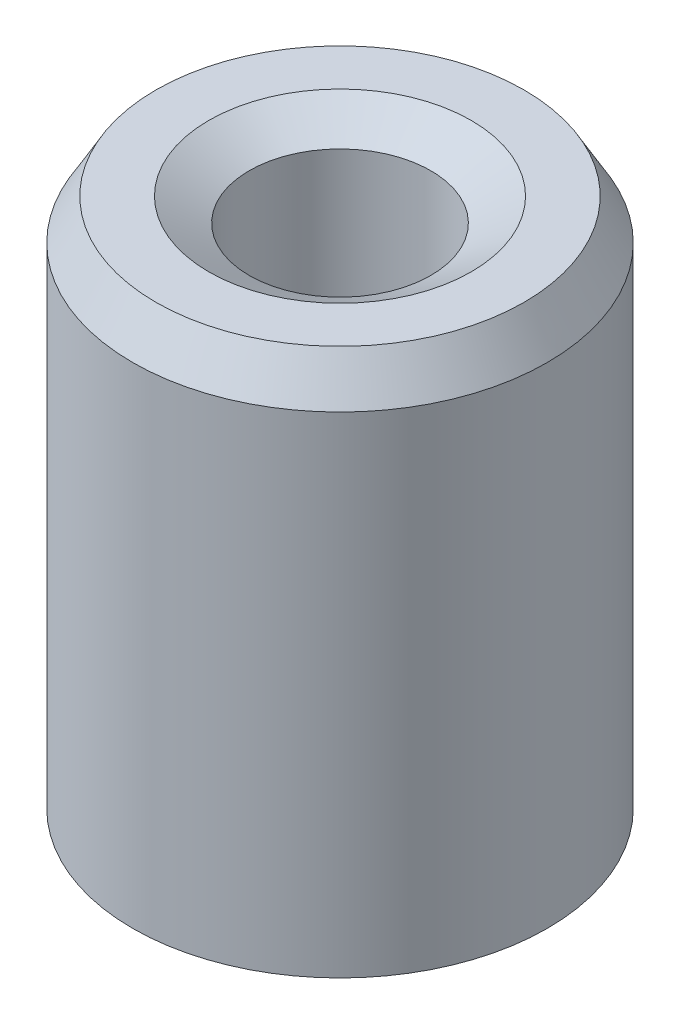
ISO-10303-21;
HEADER;
FILE_DESCRIPTION(('STEP AP214'),'2;1');
FILE_NAME('part.step','',(''),(''),'','','');
FILE_SCHEMA(('AUTOMOTIVE_DESIGN { 1 0 10303 214 1 1 1 1 }'));
ENDSEC;
DATA;
#1=APPLICATION_CONTEXT('core data for automotive mechanical design processes');
#2=APPLICATION_PROTOCOL_DEFINITION('international standard','automotive_design',2000,#1);
#3=PRODUCT_CONTEXT('',#1,'mechanical');
#4=PRODUCT('Part','Part','',(#3));
#5=PRODUCT_RELATED_PRODUCT_CATEGORY('part','',(#4));
#6=PRODUCT_DEFINITION_FORMATION('','',#4);
#7=PRODUCT_DEFINITION_CONTEXT('part definition',#1,'design');
#8=PRODUCT_DEFINITION('design','',#6,#7);
#9=PRODUCT_DEFINITION_SHAPE('','',#8);
#10=(LENGTH_UNIT() NAMED_UNIT(*) SI_UNIT(.MILLI.,.METRE.));
#11=(NAMED_UNIT(*) PLANE_ANGLE_UNIT() SI_UNIT($,.RADIAN.));
#12=(NAMED_UNIT(*) SI_UNIT($,.STERADIAN.) SOLID_ANGLE_UNIT());
#13=UNCERTAINTY_MEASURE_WITH_UNIT(LENGTH_MEASURE(1.E-05),#10,'distance_accuracy_value','');
#14=(GEOMETRIC_REPRESENTATION_CONTEXT(3) GLOBAL_UNCERTAINTY_ASSIGNED_CONTEXT((#13)) GLOBAL_UNIT_ASSIGNED_CONTEXT((#10,
#11,#12)) REPRESENTATION_CONTEXT('',''));
#15=CARTESIAN_POINT('',(0.,0.,0.));
#16=DIRECTION('',(0.,0.,1.));
#17=DIRECTION('',(1.,0.,0.));
#18=AXIS2_PLACEMENT_3D('',#15,#16,#17);
#19=CARTESIAN_POINT('',(0.,26.7104397445889,0.));
#20=DIRECTION('',(0.,-1.,0.));
#21=DIRECTION('',(0.,0.,-1.));
#22=AXIS2_PLACEMENT_3D('',#19,#20,#21);
#23=CYLINDRICAL_SURFACE('',#22,10.);
#24=CARTESIAN_POINT('',(0.,1.12518694802206,0.));
#25=DIRECTION('',(0.,1.,0.));
#26=DIRECTION('',(0.,0.,1.));
#27=AXIS2_PLACEMENT_3D('',#24,#25,#26);
#28=CIRCLE('',#27,10.);
#29=CARTESIAN_POINT('',(0.,1.12518694802206,10.));
#30=VERTEX_POINT('',#29);
#31=EDGE_CURVE('E10',#30,#30,#28,.T.);
#32=ORIENTED_EDGE('',*,*,#31,.T.);
#33=EDGE_LOOP('',(#32));
#34=FACE_BOUND('',#33,.T.);
#35=CARTESIAN_POINT('',(0.,24.7615587826013,0.));
#36=DIRECTION('',(0.,1.,0.));
#37=DIRECTION('',(0.,0.,1.));
#38=AXIS2_PLACEMENT_3D('',#35,#36,#37);
#39=CIRCLE('',#38,10.);
#40=CARTESIAN_POINT('',(0.,24.7615587826013,-10.));
#41=VERTEX_POINT('',#40);
#42=EDGE_CURVE('E50',#41,#41,#39,.F.);
#43=ORIENTED_EDGE('',*,*,#42,.T.);
#44=EDGE_LOOP('',(#43));
#45=FACE_BOUND('',#44,.T.);
#46=ADVANCED_FACE('F39',(#34,#45),#23,.T.);
#47=CARTESIAN_POINT('',(0.,26.7104397445889,0.));
#48=DIRECTION('',(0.,1.,0.));
#49=DIRECTION('',(0.,0.,1.));
#50=AXIS2_PLACEMENT_3D('',#47,#48,#49);
#51=PLANE('',#50);
#52=CARTESIAN_POINT('',(0.,26.7104397445889,0.));
#53=DIRECTION('',(0.,1.,0.));
#54=DIRECTION('',(0.,0.,1.));
#55=AXIS2_PLACEMENT_3D('',#52,#53,#54);
#56=CIRCLE('',#55,6.32801294630618);
#57=CARTESIAN_POINT('',(0.,26.7104397445889,6.32801294630618));
#58=VERTEX_POINT('',#57);
#59=EDGE_CURVE('E58',#58,#58,#56,.F.);
#60=ORIENTED_EDGE('',*,*,#59,.T.);
#61=EDGE_LOOP('',(#60));
#62=FACE_BOUND('',#61,.T.);
#63=CARTESIAN_POINT('',(0.,26.7104397445889,0.));
#64=DIRECTION('',(0.,1.,0.));
#65=DIRECTION('',(0.,0.,1.));
#66=AXIS2_PLACEMENT_3D('',#63,#64,#65);
#67=CIRCLE('',#66,8.87481305197793);
#68=CARTESIAN_POINT('',(0.,26.7104397445889,-8.87481305197793));
#69=VERTEX_POINT('',#68);
#70=EDGE_CURVE('E61',#69,#69,#67,.T.);
#71=ORIENTED_EDGE('',*,*,#70,.T.);
#72=EDGE_LOOP('',(#71));
#73=FACE_BOUND('',#72,.T.);
#74=ADVANCED_FACE('F88',(#62,#73),#51,.T.);
#75=CARTESIAN_POINT('',(0.,0.,0.));
#76=DIRECTION('',(0.,1.,0.));
#77=DIRECTION('',(0.,0.,1.));
#78=AXIS2_PLACEMENT_3D('',#75,#76,#77);
#79=PLANE('',#78);
#80=CARTESIAN_POINT('',(0.,0.,0.));
#81=DIRECTION('',(0.,1.,0.));
#82=DIRECTION('',(0.,0.,1.));
#83=AXIS2_PLACEMENT_3D('',#80,#81,#82);
#84=CIRCLE('',#83,5.50431893234064);
#85=CARTESIAN_POINT('',(0.,0.,5.50431893234064));
#86=VERTEX_POINT('',#85);
#87=EDGE_CURVE('E51',#86,#86,#84,.T.);
#88=ORIENTED_EDGE('',*,*,#87,.T.);
#89=EDGE_LOOP('',(#88));
#90=FACE_BOUND('',#89,.T.);
#91=CARTESIAN_POINT('',(0.,0.,0.));
#92=DIRECTION('',(0.,1.,0.));
#93=DIRECTION('',(0.,0.,1.));
#94=AXIS2_PLACEMENT_3D('',#91,#92,#93);
#95=CIRCLE('',#94,8.05111903801241);
#96=CARTESIAN_POINT('',(0.,0.,8.05111903801241));
#97=VERTEX_POINT('',#96);
#98=EDGE_CURVE('E54',#97,#97,#95,.F.);
#99=ORIENTED_EDGE('',*,*,#98,.T.);
#100=EDGE_LOOP('',(#99));
#101=FACE_BOUND('',#100,.T.);
#102=ADVANCED_FACE('F83',(#90,#101),#79,.F.);
#103=CARTESIAN_POINT('',(0.,26.7104397445889,0.));
#104=DIRECTION('',(0.,-1.,0.));
#105=DIRECTION('',(0.,0.,-1.));
#106=AXIS2_PLACEMENT_3D('',#103,#104,#105);
#107=CYLINDRICAL_SURFACE('',#106,4.37913198431858);
#108=CARTESIAN_POINT('',(0.,25.5852527965669,0.));
#109=DIRECTION('',(0.,1.,0.));
#110=DIRECTION('',(0.,0.,1.));
#111=AXIS2_PLACEMENT_3D('',#108,#109,#110);
#112=CIRCLE('',#111,4.37913198431858);
#113=CARTESIAN_POINT('',(0.,25.5852527965669,4.37913198431858));
#114=VERTEX_POINT('',#113);
#115=EDGE_CURVE('E67',#114,#114,#112,.T.);
#116=ORIENTED_EDGE('',*,*,#115,.T.);
#117=EDGE_LOOP('',(#116));
#118=FACE_BOUND('',#117,.T.);
#119=CARTESIAN_POINT('',(0.,1.94888096198759,0.));
#120=DIRECTION('',(0.,1.,0.));
#121=DIRECTION('',(0.,0.,1.));
#122=AXIS2_PLACEMENT_3D('',#119,#120,#121);
#123=CIRCLE('',#122,4.37913198431858);
#124=CARTESIAN_POINT('',(0.,1.94888096198759,4.37913198431858));
#125=VERTEX_POINT('',#124);
#126=EDGE_CURVE('E69',#125,#125,#123,.F.);
#127=ORIENTED_EDGE('',*,*,#126,.T.);
#128=EDGE_LOOP('',(#127));
#129=FACE_BOUND('',#128,.T.);
#130=ADVANCED_FACE('F71',(#118,#129),#107,.F.);
#131=CARTESIAN_POINT('',(0.,25.5852527965669,0.));
#132=DIRECTION('',(0.,1.,0.));
#133=DIRECTION('',(0.,0.,1.));
#134=AXIS2_PLACEMENT_3D('',#131,#132,#133);
#135=CONICAL_SURFACE('',#134,4.37913198431858,1.0471975511966);
#136=ORIENTED_EDGE('',*,*,#59,.F.);
#137=EDGE_LOOP('',(#136));
#138=FACE_BOUND('',#137,.T.);
#139=ORIENTED_EDGE('',*,*,#115,.F.);
#140=EDGE_LOOP('',(#139));
#141=FACE_BOUND('',#140,.T.);
#142=ADVANCED_FACE('F77',(#138,#141),#135,.F.);
#143=CARTESIAN_POINT('',(0.,0.,0.));
#144=DIRECTION('',(0.,-1.,0.));
#145=DIRECTION('',(0.,0.,-1.));
#146=AXIS2_PLACEMENT_3D('',#143,#144,#145);
#147=CONICAL_SURFACE('',#146,5.50431893234064,0.523598775598295);
#148=ORIENTED_EDGE('',*,*,#126,.F.);
#149=EDGE_LOOP('',(#148));
#150=FACE_BOUND('',#149,.T.);
#151=ORIENTED_EDGE('',*,*,#87,.F.);
#152=EDGE_LOOP('',(#151));
#153=FACE_BOUND('',#152,.T.);
#154=ADVANCED_FACE('F73',(#150,#153),#147,.F.);
#155=CARTESIAN_POINT('',(0.,1.12518694802206,0.));
#156=DIRECTION('',(0.,1.,0.));
#157=DIRECTION('',(0.,0.,1.));
#158=AXIS2_PLACEMENT_3D('',#155,#156,#157);
#159=CONICAL_SURFACE('',#158,10.,1.0471975511966);
#160=ORIENTED_EDGE('',*,*,#98,.F.);
#161=EDGE_LOOP('',(#160));
#162=FACE_BOUND('',#161,.T.);
#163=ORIENTED_EDGE('',*,*,#31,.F.);
#164=EDGE_LOOP('',(#163));
#165=FACE_BOUND('',#164,.T.);
#166=ADVANCED_FACE('F76',(#162,#165),#159,.T.);
#167=CARTESIAN_POINT('',(0.,26.7104397445889,0.));
#168=DIRECTION('',(0.,-1.,0.));
#169=DIRECTION('',(0.,0.,-1.));
#170=AXIS2_PLACEMENT_3D('',#167,#168,#169);
#171=CONICAL_SURFACE('',#170,8.87481305197793,0.523598775598295);
#172=CARTESIAN_POINT('',(0.,24.7615587826013,-10.));
#173=CARTESIAN_POINT('',(0.,24.7818596259553,-9.98827930262477));
#174=CARTESIAN_POINT('',(0.,24.8021604693094,-9.97655860524954));
#175=CARTESIAN_POINT('',(0.,24.8427621560175,-9.95311721049908));
#176=CARTESIAN_POINT('',(0.,24.8630629993715,-9.94139651312385));
#177=CARTESIAN_POINT('',(0.,24.9036646860796,-9.91795511837339));
#178=CARTESIAN_POINT('',(0.,24.9239655294336,-9.90623442099816));
#179=CARTESIAN_POINT('',(0.,24.9645672161417,-9.8827930262477));
#180=CARTESIAN_POINT('',(0.,24.9848680594957,-9.87107232887247));
#181=CARTESIAN_POINT('',(0.,25.0254697462038,-9.84763093412201));
#182=CARTESIAN_POINT('',(0.,25.0457705895578,-9.83591023674679));
#183=CARTESIAN_POINT('',(0.,25.0863722762659,-9.81246884199632));
#184=CARTESIAN_POINT('',(0.,25.10667311962,-9.80074814462109));
#185=CARTESIAN_POINT('',(0.,25.147274806328,-9.77730674987063));
#186=CARTESIAN_POINT('',(0.,25.1675756496821,-9.76558605249541));
#187=CARTESIAN_POINT('',(0.,25.2081773363901,-9.74214465774494));
#188=CARTESIAN_POINT('',(0.,25.2284781797442,-9.73042396036971));
#189=CARTESIAN_POINT('',(0.,25.2690798664523,-9.70698256561925));
#190=CARTESIAN_POINT('',(0.,25.2893807098063,-9.69526186824402));
#191=CARTESIAN_POINT('',(0.,25.3299823965144,-9.67182047349356));
#192=CARTESIAN_POINT('',(0.,25.3502832398684,-9.66009977611833));
#193=CARTESIAN_POINT('',(0.,25.3908849265765,-9.63665838136787));
#194=CARTESIAN_POINT('',(0.,25.4111857699305,-9.62493768399264));
#195=CARTESIAN_POINT('',(0.,25.4517874566386,-9.60149628924218));
#196=CARTESIAN_POINT('',(0.,25.4720882999926,-9.58977559186695));
#197=CARTESIAN_POINT('',(0.,25.5126899867007,-9.5663341971165));
#198=CARTESIAN_POINT('',(0.,25.5329908300547,-9.55461349974127));
#199=CARTESIAN_POINT('',(0.,25.5735925167628,-9.53117210499081));
#200=CARTESIAN_POINT('',(0.,25.5938933601169,-9.51945140761558));
#201=CARTESIAN_POINT('',(0.,25.6344950468249,-9.49601001286512));
#202=CARTESIAN_POINT('',(0.,25.654795890179,-9.48428931548989));
#203=CARTESIAN_POINT('',(0.,25.695397576887,-9.46084792073943));
#204=CARTESIAN_POINT('',(0.,25.7156984202411,-9.4491272233642));
#205=CARTESIAN_POINT('',(0.,25.7563001069492,-9.42568582861374));
#206=CARTESIAN_POINT('',(0.,25.7766009503032,-9.41396513123851));
#207=CARTESIAN_POINT('',(0.,25.8172026370113,-9.39052373648805));
#208=CARTESIAN_POINT('',(0.,25.8375034803653,-9.37880303911282));
#209=CARTESIAN_POINT('',(0.,25.8781051670734,-9.35536164436236));
#210=CARTESIAN_POINT('',(0.,25.8984060104274,-9.34364094698713));
#211=CARTESIAN_POINT('',(0.,25.9390076971355,-9.32019955223667));
#212=CARTESIAN_POINT('',(0.,25.9593085404895,-9.30847885486144));
#213=CARTESIAN_POINT('',(0.,25.9999102271976,-9.28503746011098));
#214=CARTESIAN_POINT('',(0.,26.0202110705516,-9.27331676273575));
#215=CARTESIAN_POINT('',(0.,26.0608127572597,-9.24987536798529));
#216=CARTESIAN_POINT('',(0.,26.0811136006138,-9.23815467061006));
#217=CARTESIAN_POINT('',(0.,26.1217152873218,-9.2147132758596));
#218=CARTESIAN_POINT('',(0.,26.1420161306759,-9.20299257848437));
#219=CARTESIAN_POINT('',(0.,26.1826178173839,-9.17955118373391));
#220=CARTESIAN_POINT('',(0.,26.202918660738,-9.16783048635868));
#221=CARTESIAN_POINT('',(0.,26.2435203474461,-9.14438909160822));
#222=CARTESIAN_POINT('',(0.,26.2638211908001,-9.13266839423299));
#223=CARTESIAN_POINT('',(0.,26.3044228775082,-9.10922699948253));
#224=CARTESIAN_POINT('',(0.,26.3247237208622,-9.0975063021073));
#225=CARTESIAN_POINT('',(0.,26.3653254075703,-9.07406490735684));
#226=CARTESIAN_POINT('',(0.,26.3856262509243,-9.06234420998161));
#227=CARTESIAN_POINT('',(0.,26.4262279376324,-9.03890281523115));
#228=CARTESIAN_POINT('',(0.,26.4465287809864,-9.02718211785592));
#229=CARTESIAN_POINT('',(0.,26.4871304676945,-9.00374072310546));
#230=CARTESIAN_POINT('',(0.,26.5074313110485,-8.99202002573023));
#231=CARTESIAN_POINT('',(0.,26.5480329977566,-8.96857863097977));
#232=CARTESIAN_POINT('',(0.,26.5683338411107,-8.95685793360454));
#233=CARTESIAN_POINT('',(0.,26.6089355278187,-8.93341653885408));
#234=CARTESIAN_POINT('',(0.,26.6292363711728,-8.92169584147885));
#235=CARTESIAN_POINT('',(0.,26.6698380578808,-8.89825444672839));
#236=CARTESIAN_POINT('',(0.,26.6901389012349,-8.88653374935316));
#237=CARTESIAN_POINT('',(0.,26.7104397445889,-8.87481305197793));
#238=B_SPLINE_CURVE_WITH_KNOTS('',3,(#172,#173,#174,#175,#176,#177,#178,#179,#180,#181,#182,
#183,#184,#185,#186,#187,#188,#189,#190,#191,#192,#193,#194,#195,#196,#197,#198,#199,#200,#201,
#202,#203,#204,#205,#206,#207,#208,#209,#210,#211,#212,#213,#214,#215,#216,#217,#218,#219,#220,
#221,#222,#223,#224,#225,#226,#227,#228,#229,#230,#231,#232,#233,#234,#235,#236,#237),
.UNSPECIFIED.,.F.,.F.,(4,2,2,2,2,2,2,2,2,2,2,2,2,2,2,2,2,2,2,2,2,2,2,2,2,2,2,2,2,2,2,2,4),(0.,
0.0703241842513814,0.140648368502762,0.210972552754143,0.281296737005521,0.351620921256902,
0.421945105508283,0.492269289759664,0.562593474011042,0.632917658262423,0.703241842513804,
0.773566026765182,0.843890211016563,0.914214395267944,0.984538579519324,1.0548627637707,
1.12518694802208,1.19551113227346,1.26583531652484,1.33615950077622,1.4064836850276,
1.47680786927898,1.54713205353036,1.61745623778174,1.68778042203312,1.7581046062845,
1.82842879053588,1.89875297478726,1.96907715903865,2.03940134329002,2.1097255275414,
2.18004971179279,2.25037389604417),.UNSPECIFIED.);
#239=EDGE_CURVE('BSEAM45',#41,#69,#238,.T.);
#240=ORIENTED_EDGE('',*,*,#42,.F.);
#241=ORIENTED_EDGE('',*,*,#70,.F.);
#242=ORIENTED_EDGE('',*,*,#239,.T.);
#243=ORIENTED_EDGE('',*,*,#239,.F.);
#244=EDGE_LOOP('',(#240,#242,#241,#243));
#245=FACE_BOUND('',#244,.T.);
#246=ADVANCED_FACE('F45',(#245),#171,.T.);
#247=CLOSED_SHELL('',(#46,#74,#102,#130,#142,#154,#166,#246));
#248=MANIFOLD_SOLID_BREP('B2',#247);
#249=ADVANCED_BREP_SHAPE_REPRESENTATION('',(#18,#248),#14);
#250=SHAPE_DEFINITION_REPRESENTATION(#9,#249);
ENDSEC;
END-ISO-10303-21;
